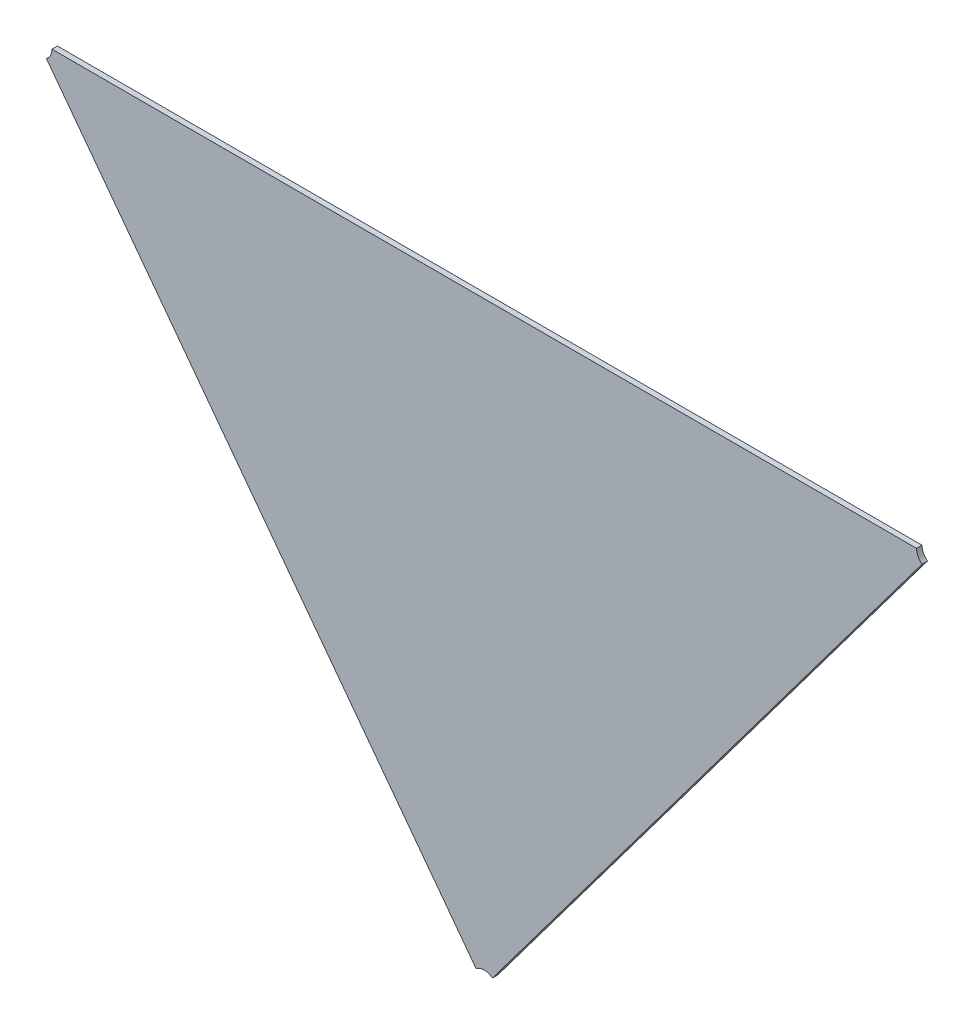
ISO-10303-21;
HEADER;
FILE_DESCRIPTION(('STEP AP214'),'2;1');
FILE_NAME('part.step','',(''),(''),'','','');
FILE_SCHEMA(('AUTOMOTIVE_DESIGN { 1 0 10303 214 1 1 1 1 }'));
ENDSEC;
DATA;
#1=APPLICATION_CONTEXT('core data for automotive mechanical design processes');
#2=APPLICATION_PROTOCOL_DEFINITION('international standard','automotive_design',2000,#1);
#3=PRODUCT_CONTEXT('',#1,'mechanical');
#4=PRODUCT('Part','Part','',(#3));
#5=PRODUCT_RELATED_PRODUCT_CATEGORY('part','',(#4));
#6=PRODUCT_DEFINITION_FORMATION('','',#4);
#7=PRODUCT_DEFINITION_CONTEXT('part definition',#1,'design');
#8=PRODUCT_DEFINITION('design','',#6,#7);
#9=PRODUCT_DEFINITION_SHAPE('','',#8);
#10=(LENGTH_UNIT() NAMED_UNIT(*) SI_UNIT(.MILLI.,.METRE.));
#11=(NAMED_UNIT(*) PLANE_ANGLE_UNIT() SI_UNIT($,.RADIAN.));
#12=(NAMED_UNIT(*) SI_UNIT($,.STERADIAN.) SOLID_ANGLE_UNIT());
#13=UNCERTAINTY_MEASURE_WITH_UNIT(LENGTH_MEASURE(1.E-05),#10,'distance_accuracy_value','');
#14=(GEOMETRIC_REPRESENTATION_CONTEXT(3) GLOBAL_UNCERTAINTY_ASSIGNED_CONTEXT((#13)) GLOBAL_UNIT_ASSIGNED_CONTEXT((#10,
#11,#12)) REPRESENTATION_CONTEXT('',''));
#15=CARTESIAN_POINT('',(0.,0.,0.));
#16=DIRECTION('',(0.,0.,1.));
#17=DIRECTION('',(1.,0.,0.));
#18=AXIS2_PLACEMENT_3D('',#15,#16,#17);
#19=CARTESIAN_POINT('',(-1.48475928303721,-1.12586984778094,0.002));
#20=DIRECTION('',(0.,0.,1.));
#21=DIRECTION('',(1.,0.,0.));
#22=AXIS2_PLACEMENT_3D('',#19,#20,#21);
#23=PLANE('',#22);
#24=CARTESIAN_POINT('',(-1.7016489577392,-1.04446386523316,0.002));
#25=DIRECTION('',(0.,0.,-1.));
#26=DIRECTION('',(1.,0.,0.));
#27=AXIS2_PLACEMENT_3D('',#24,#25,#26);
#28=CIRCLE('',#27,0.00499999999999997);
#29=CARTESIAN_POINT('',(-1.6966489577392,-1.04446386523316,0.002));
#30=VERTEX_POINT('',#29);
#31=CARTESIAN_POINT('',(-1.69865032362495,-1.04846488928318,0.002));
#32=VERTEX_POINT('',#31);
#33=EDGE_CURVE('E11',#30,#32,#28,.T.);
#34=ORIENTED_EDGE('',*,*,#33,.T.);
#35=DIRECTION('',(-0.599726822848934,0.800204810005241,0.));
#36=VECTOR('',#35,1.);
#37=CARTESIAN_POINT('',(-1.54197455062618,-1.25751458055652,0.002));
#38=LINE('',#37,#36);
#39=CARTESIAN_POINT('',(-1.54197455062618,-1.25751458055652,0.002));
#40=VERTEX_POINT('',#39);
#41=EDGE_CURVE('E114',#40,#32,#38,.T.);
#42=ORIENTED_EDGE('',*,*,#41,.F.);
#43=CARTESIAN_POINT('',(-1.53897591651193,-1.26151560460655,0.002));
#44=DIRECTION('',(0.,0.,-1.));
#45=DIRECTION('',(-0.599726822849234,0.800204810005016,0.));
#46=AXIS2_PLACEMENT_3D('',#43,#44,#45);
#47=CIRCLE('',#46,0.00500000000000008);
#48=CARTESIAN_POINT('',(-1.53597728239769,-1.25751458055652,0.002));
#49=VERTEX_POINT('',#48);
#50=EDGE_CURVE('E90',#40,#49,#47,.T.);
#51=ORIENTED_EDGE('',*,*,#50,.T.);
#52=DIRECTION('',(0.599726822848934,0.800204810005241,0.));
#53=VECTOR('',#52,1.);
#54=CARTESIAN_POINT('',(-1.53597728239769,-1.25751458055652,0.002));
#55=LINE('',#54,#53);
#56=CARTESIAN_POINT('',(-1.37930150939891,-1.04846488928318,0.002));
#57=VERTEX_POINT('',#56);
#58=EDGE_CURVE('E102',#49,#57,#55,.T.);
#59=ORIENTED_EDGE('',*,*,#58,.T.);
#60=CARTESIAN_POINT('',(-1.37630287528467,-1.04446386523316,0.002));
#61=DIRECTION('',(0.,0.,-1.));
#62=DIRECTION('',(-0.599726822848928,-0.800204810005245,0.));
#63=AXIS2_PLACEMENT_3D('',#60,#61,#62);
#64=CIRCLE('',#63,0.00500000000000005);
#65=CARTESIAN_POINT('',(-1.38130287528466,-1.04446386523316,0.002));
#66=VERTEX_POINT('',#65);
#67=EDGE_CURVE('E77',#57,#66,#64,.T.);
#68=ORIENTED_EDGE('',*,*,#67,.T.);
#69=DIRECTION('',(-1.,0.,0.));
#70=VECTOR('',#69,1.);
#71=CARTESIAN_POINT('',(-1.38130287528466,-1.04446386523316,0.002));
#72=LINE('',#71,#70);
#73=EDGE_CURVE('E110',#66,#30,#72,.T.);
#74=ORIENTED_EDGE('',*,*,#73,.T.);
#75=EDGE_LOOP('',(#34,#42,#51,#59,#68,#74));
#76=FACE_BOUND('',#75,.T.);
#77=ADVANCED_FACE('F17',(#76),#23,.T.);
#78=CARTESIAN_POINT('',(-1.37630287528467,-1.04446386523316,0.));
#79=DIRECTION('',(0.,1.,0.));
#80=DIRECTION('',(-1.,0.,0.));
#81=AXIS2_PLACEMENT_3D('',#78,#79,#80);
#82=PLANE('',#81);
#83=DIRECTION('',(-1.11022302462516E-13,0.,1.));
#84=VECTOR('',#83,1.);
#85=CARTESIAN_POINT('',(-1.6966489577392,-1.04446386523316,0.));
#86=LINE('',#85,#84);
#87=CARTESIAN_POINT('',(-1.6966489577392,-1.04446386523316,0.));
#88=VERTEX_POINT('',#87);
#89=EDGE_CURVE('E24',#88,#30,#86,.T.);
#90=ORIENTED_EDGE('',*,*,#89,.T.);
#91=ORIENTED_EDGE('',*,*,#73,.F.);
#92=DIRECTION('',(-1.11022302462516E-13,0.,-1.));
#93=VECTOR('',#92,1.);
#94=CARTESIAN_POINT('',(-1.38130287528466,-1.04446386523316,0.002));
#95=LINE('',#94,#93);
#96=CARTESIAN_POINT('',(-1.38130287528466,-1.04446386523316,0.));
#97=VERTEX_POINT('',#96);
#98=EDGE_CURVE('E104',#66,#97,#95,.T.);
#99=ORIENTED_EDGE('',*,*,#98,.T.);
#100=DIRECTION('',(-1.,0.,0.));
#101=VECTOR('',#100,1.);
#102=CARTESIAN_POINT('',(-1.38130287528466,-1.04446386523316,0.));
#103=LINE('',#102,#101);
#104=EDGE_CURVE('E99',#97,#88,#103,.T.);
#105=ORIENTED_EDGE('',*,*,#104,.T.);
#106=EDGE_LOOP('',(#90,#91,#99,#105));
#107=FACE_BOUND('',#106,.T.);
#108=ADVANCED_FACE('F119',(#107),#82,.T.);
#109=CARTESIAN_POINT('',(-1.53897591651193,-1.26151560460655,0.));
#110=DIRECTION('',(0.800204810005241,-0.599726822848934,0.));
#111=DIRECTION('',(0.599726822848934,0.800204810005241,0.));
#112=AXIS2_PLACEMENT_3D('',#109,#110,#111);
#113=PLANE('',#112);
#114=DIRECTION('',(0.,0.,-1.));
#115=VECTOR('',#114,1.);
#116=CARTESIAN_POINT('',(-1.53597728239769,-1.25751458055652,0.002));
#117=LINE('',#116,#115);
#118=CARTESIAN_POINT('',(-1.53597728239769,-1.25751458055652,0.));
#119=VERTEX_POINT('',#118);
#120=EDGE_CURVE('E112',#49,#119,#117,.T.);
#121=ORIENTED_EDGE('',*,*,#120,.T.);
#122=DIRECTION('',(0.599726822848934,0.800204810005241,0.));
#123=VECTOR('',#122,1.);
#124=CARTESIAN_POINT('',(-1.53597728239769,-1.25751458055652,0.));
#125=LINE('',#124,#123);
#126=CARTESIAN_POINT('',(-1.37930150939891,-1.04846488928318,0.));
#127=VERTEX_POINT('',#126);
#128=EDGE_CURVE('E85',#119,#127,#125,.T.);
#129=ORIENTED_EDGE('',*,*,#128,.T.);
#130=DIRECTION('',(0.,0.,1.));
#131=VECTOR('',#130,1.);
#132=CARTESIAN_POINT('',(-1.37930150939891,-1.04846488928318,0.));
#133=LINE('',#132,#131);
#134=EDGE_CURVE('E96',#127,#57,#133,.T.);
#135=ORIENTED_EDGE('',*,*,#134,.T.);
#136=ORIENTED_EDGE('',*,*,#58,.F.);
#137=EDGE_LOOP('',(#121,#129,#135,#136));
#138=FACE_BOUND('',#137,.T.);
#139=ADVANCED_FACE('F127',(#138),#113,.T.);
#140=CARTESIAN_POINT('',(-1.48475928303721,-1.12586984778094,0.));
#141=DIRECTION('',(0.,0.,1.));
#142=DIRECTION('',(1.,0.,0.));
#143=AXIS2_PLACEMENT_3D('',#140,#141,#142);
#144=PLANE('',#143);
#145=CARTESIAN_POINT('',(-1.7016489577392,-1.04446386523316,0.));
#146=DIRECTION('',(0.,0.,1.));
#147=DIRECTION('',(0.599726822850193,-0.800204810004297,0.));
#148=AXIS2_PLACEMENT_3D('',#145,#146,#147);
#149=CIRCLE('',#148,0.00499999999999997);
#150=CARTESIAN_POINT('',(-1.69865032362495,-1.04846488928318,0.));
#151=VERTEX_POINT('',#150);
#152=EDGE_CURVE('E107',#151,#88,#149,.T.);
#153=ORIENTED_EDGE('',*,*,#152,.T.);
#154=ORIENTED_EDGE('',*,*,#104,.F.);
#155=CARTESIAN_POINT('',(-1.37630287528467,-1.04446386523316,0.));
#156=DIRECTION('',(0.,0.,1.));
#157=DIRECTION('',(-1.,0.,0.));
#158=AXIS2_PLACEMENT_3D('',#155,#156,#157);
#159=CIRCLE('',#158,0.00500000000000005);
#160=EDGE_CURVE('E78',#97,#127,#159,.T.);
#161=ORIENTED_EDGE('',*,*,#160,.T.);
#162=ORIENTED_EDGE('',*,*,#128,.F.);
#163=CARTESIAN_POINT('',(-1.53897591651193,-1.26151560460655,0.));
#164=DIRECTION('',(0.,0.,1.));
#165=DIRECTION('',(0.59972682284799,0.800204810005948,0.));
#166=AXIS2_PLACEMENT_3D('',#163,#164,#165);
#167=CIRCLE('',#166,0.00500000000000008);
#168=CARTESIAN_POINT('',(-1.54197455062618,-1.25751458055652,0.));
#169=VERTEX_POINT('',#168);
#170=EDGE_CURVE('E82',#119,#169,#167,.T.);
#171=ORIENTED_EDGE('',*,*,#170,.T.);
#172=DIRECTION('',(-0.599726822848934,0.800204810005241,0.));
#173=VECTOR('',#172,1.);
#174=CARTESIAN_POINT('',(-1.54197455062618,-1.25751458055652,0.));
#175=LINE('',#174,#173);
#176=EDGE_CURVE('E67',#169,#151,#175,.T.);
#177=ORIENTED_EDGE('',*,*,#176,.T.);
#178=EDGE_LOOP('',(#153,#154,#161,#162,#171,#177));
#179=FACE_BOUND('',#178,.T.);
#180=ADVANCED_FACE('F83',(#179),#144,.F.);
#181=CARTESIAN_POINT('',(-1.53897591651193,-1.26151560460655,0.));
#182=DIRECTION('',(0.800204810005241,0.599726822848934,0.));
#183=DIRECTION('',(-0.599726822848934,0.800204810005241,0.));
#184=AXIS2_PLACEMENT_3D('',#181,#182,#183);
#185=PLANE('',#184);
#186=DIRECTION('',(0.,0.,-1.));
#187=VECTOR('',#186,1.);
#188=CARTESIAN_POINT('',(-1.69865032362495,-1.04846488928318,0.002));
#189=LINE('',#188,#187);
#190=EDGE_CURVE('E74',#32,#151,#189,.T.);
#191=ORIENTED_EDGE('',*,*,#190,.T.);
#192=ORIENTED_EDGE('',*,*,#176,.F.);
#193=DIRECTION('',(0.,0.,1.));
#194=VECTOR('',#193,1.);
#195=CARTESIAN_POINT('',(-1.54197455062618,-1.25751458055652,0.));
#196=LINE('',#195,#194);
#197=EDGE_CURVE('E71',#169,#40,#196,.T.);
#198=ORIENTED_EDGE('',*,*,#197,.T.);
#199=ORIENTED_EDGE('',*,*,#41,.T.);
#200=EDGE_LOOP('',(#191,#192,#198,#199));
#201=FACE_BOUND('',#200,.T.);
#202=ADVANCED_FACE('F69',(#201),#185,.F.);
#203=CARTESIAN_POINT('',(-1.37630287528467,-1.04446386523316,0.002));
#204=DIRECTION('',(0.,0.,1.));
#205=DIRECTION('',(-1.,0.,0.));
#206=AXIS2_PLACEMENT_3D('',#203,#204,#205);
#207=CYLINDRICAL_SURFACE('',#206,0.00500000000000005);
#208=ORIENTED_EDGE('',*,*,#98,.F.);
#209=ORIENTED_EDGE('',*,*,#67,.F.);
#210=ORIENTED_EDGE('',*,*,#134,.F.);
#211=ORIENTED_EDGE('',*,*,#160,.F.);
#212=EDGE_LOOP('',(#208,#209,#210,#211));
#213=FACE_BOUND('',#212,.T.);
#214=ADVANCED_FACE('F123',(#213),#207,.F.);
#215=CARTESIAN_POINT('',(-1.53897591651193,-1.26151560460655,0.002));
#216=DIRECTION('',(0.,0.,1.));
#217=DIRECTION('',(-1.,0.,0.));
#218=AXIS2_PLACEMENT_3D('',#215,#216,#217);
#219=CYLINDRICAL_SURFACE('',#218,0.00500000000000008);
#220=ORIENTED_EDGE('',*,*,#120,.F.);
#221=ORIENTED_EDGE('',*,*,#50,.F.);
#222=ORIENTED_EDGE('',*,*,#197,.F.);
#223=ORIENTED_EDGE('',*,*,#170,.F.);
#224=EDGE_LOOP('',(#220,#221,#222,#223));
#225=FACE_BOUND('',#224,.T.);
#226=ADVANCED_FACE('F89',(#225),#219,.F.);
#227=CARTESIAN_POINT('',(-1.7016489577392,-1.04446386523316,0.002));
#228=DIRECTION('',(0.,0.,1.));
#229=DIRECTION('',(-1.,0.,0.));
#230=AXIS2_PLACEMENT_3D('',#227,#228,#229);
#231=CYLINDRICAL_SURFACE('',#230,0.00499999999999997);
#232=ORIENTED_EDGE('',*,*,#89,.F.);
#233=ORIENTED_EDGE('',*,*,#152,.F.);
#234=ORIENTED_EDGE('',*,*,#190,.F.);
#235=ORIENTED_EDGE('',*,*,#33,.F.);
#236=EDGE_LOOP('',(#232,#233,#234,#235));
#237=FACE_BOUND('',#236,.T.);
#238=ADVANCED_FACE('F116',(#237),#231,.F.);
#239=CLOSED_SHELL('',(#77,#108,#139,#180,#202,#214,#226,#238));
#240=MANIFOLD_SOLID_BREP('B1',#239);
#241=ADVANCED_BREP_SHAPE_REPRESENTATION('',(#18,#240),#14);
#242=SHAPE_DEFINITION_REPRESENTATION(#9,#241);
ENDSEC;
END-ISO-10303-21;
